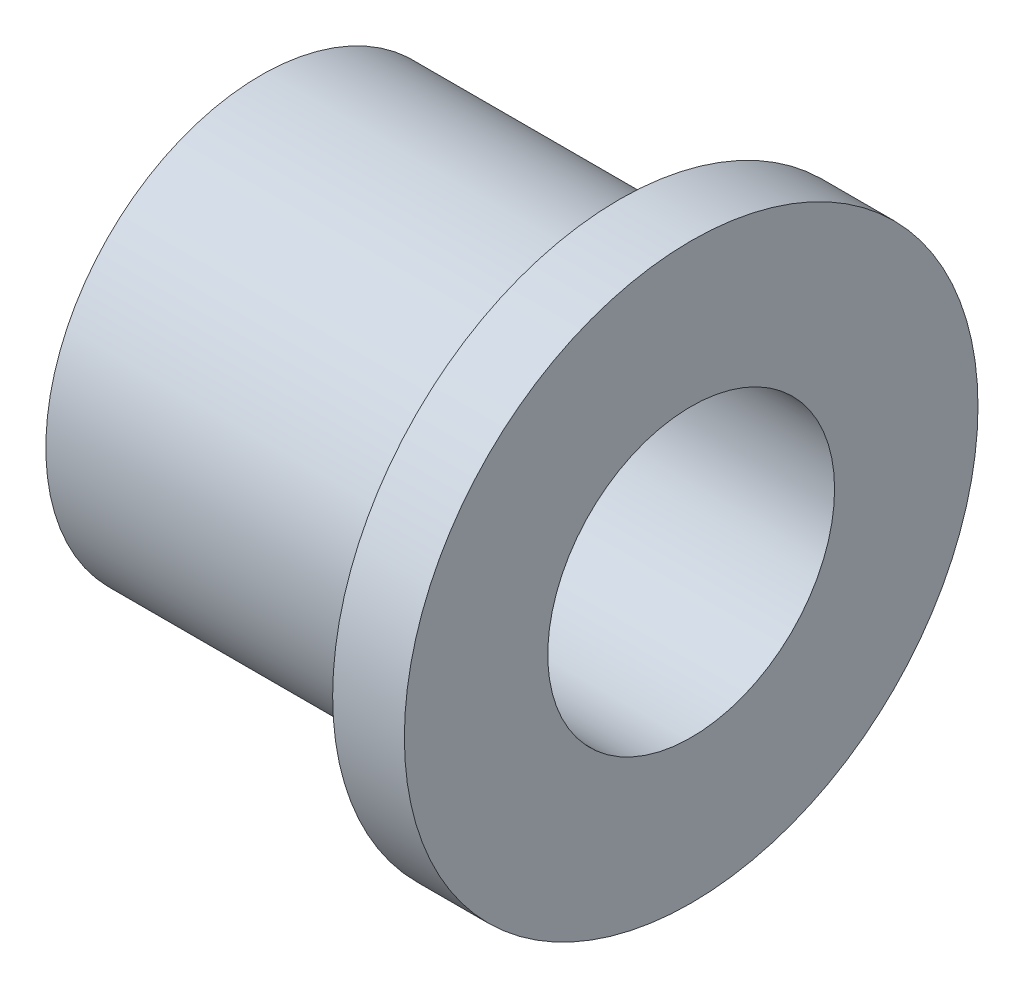
ISO-10303-21;
HEADER;
FILE_DESCRIPTION(('STEP AP214'),'2;1');
FILE_NAME('part.step','',(''),(''),'','','');
FILE_SCHEMA(('AUTOMOTIVE_DESIGN { 1 0 10303 214 1 1 1 1 }'));
ENDSEC;
DATA;
#1=APPLICATION_CONTEXT('core data for automotive mechanical design processes');
#2=APPLICATION_PROTOCOL_DEFINITION('international standard','automotive_design',2000,#1);
#3=PRODUCT_CONTEXT('',#1,'mechanical');
#4=PRODUCT('Part','Part','',(#3));
#5=PRODUCT_RELATED_PRODUCT_CATEGORY('part','',(#4));
#6=PRODUCT_DEFINITION_FORMATION('','',#4);
#7=PRODUCT_DEFINITION_CONTEXT('part definition',#1,'design');
#8=PRODUCT_DEFINITION('design','',#6,#7);
#9=PRODUCT_DEFINITION_SHAPE('','',#8);
#10=(LENGTH_UNIT() NAMED_UNIT(*) SI_UNIT(.MILLI.,.METRE.));
#11=(NAMED_UNIT(*) PLANE_ANGLE_UNIT() SI_UNIT($,.RADIAN.));
#12=(NAMED_UNIT(*) SI_UNIT($,.STERADIAN.) SOLID_ANGLE_UNIT());
#13=UNCERTAINTY_MEASURE_WITH_UNIT(LENGTH_MEASURE(1.E-05),#10,'distance_accuracy_value','');
#14=(GEOMETRIC_REPRESENTATION_CONTEXT(3) GLOBAL_UNCERTAINTY_ASSIGNED_CONTEXT((#13)) GLOBAL_UNIT_ASSIGNED_CONTEXT((#10,
#11,#12)) REPRESENTATION_CONTEXT('',''));
#15=CARTESIAN_POINT('',(0.,0.,0.));
#16=DIRECTION('',(0.,0.,1.));
#17=DIRECTION('',(1.,0.,0.));
#18=AXIS2_PLACEMENT_3D('',#15,#16,#17);
#19=CARTESIAN_POINT('',(-13.970784342,-6.4262,6.4262));
#20=DIRECTION('',(1.,0.,0.));
#21=DIRECTION('',(0.,0.,-1.));
#22=AXIS2_PLACEMENT_3D('',#19,#20,#21);
#23=PLANE('',#22);
#24=CARTESIAN_POINT('',(-13.970784342,0.,0.));
#25=DIRECTION('',(1.,0.,0.));
#26=DIRECTION('',(0.,0.,-1.));
#27=AXIS2_PLACEMENT_3D('',#24,#25,#26);
#28=CIRCLE('',#27,3.175);
#29=CARTESIAN_POINT('',(-13.970784342,0.,-3.175));
#30=VERTEX_POINT('',#29);
#31=EDGE_CURVE('E39',#30,#30,#28,.T.);
#32=ORIENTED_EDGE('',*,*,#31,.F.);
#33=EDGE_LOOP('',(#32));
#34=FACE_BOUND('',#33,.T.);
#35=CARTESIAN_POINT('',(-13.970784342,0.,0.));
#36=DIRECTION('',(1.,0.,0.));
#37=DIRECTION('',(0.,0.,-1.));
#38=AXIS2_PLACEMENT_3D('',#35,#36,#37);
#39=CIRCLE('',#38,6.35);
#40=CARTESIAN_POINT('',(-13.970784342,0.,-6.35));
#41=VERTEX_POINT('',#40);
#42=EDGE_CURVE('E18',#41,#41,#39,.T.);
#43=ORIENTED_EDGE('',*,*,#42,.T.);
#44=EDGE_LOOP('',(#43));
#45=FACE_BOUND('',#44,.T.);
#46=ADVANCED_FACE('F14',(#34,#45),#23,.T.);
#47=CARTESIAN_POINT('',(-15.558284342,0.,0.));
#48=DIRECTION('',(1.,0.,0.));
#49=DIRECTION('',(0.,0.,-1.));
#50=AXIS2_PLACEMENT_3D('',#47,#48,#49);
#51=CYLINDRICAL_SURFACE('',#50,6.35);
#52=ORIENTED_EDGE('',*,*,#42,.F.);
#53=EDGE_LOOP('',(#52));
#54=FACE_BOUND('',#53,.T.);
#55=CARTESIAN_POINT('',(-15.558284342,0.,0.));
#56=DIRECTION('',(1.,0.,0.));
#57=DIRECTION('',(0.,0.,-1.));
#58=AXIS2_PLACEMENT_3D('',#55,#56,#57);
#59=CIRCLE('',#58,6.35);
#60=CARTESIAN_POINT('',(-15.558284342,0.,-6.35));
#61=VERTEX_POINT('',#60);
#62=EDGE_CURVE('E37',#61,#61,#59,.F.);
#63=ORIENTED_EDGE('',*,*,#62,.F.);
#64=EDGE_LOOP('',(#63));
#65=FACE_BOUND('',#64,.T.);
#66=ADVANCED_FACE('F49',(#54,#65),#51,.T.);
#67=CARTESIAN_POINT('',(-23.495784342,0.,0.));
#68=DIRECTION('',(1.,0.,0.));
#69=DIRECTION('',(0.,0.,-1.));
#70=AXIS2_PLACEMENT_3D('',#67,#68,#69);
#71=CYLINDRICAL_SURFACE('',#70,3.175);
#72=ORIENTED_EDGE('',*,*,#31,.T.);
#73=EDGE_LOOP('',(#72));
#74=FACE_BOUND('',#73,.T.);
#75=CARTESIAN_POINT('',(-23.495784342,0.,0.));
#76=DIRECTION('',(1.,0.,0.));
#77=DIRECTION('',(0.,0.,-1.));
#78=AXIS2_PLACEMENT_3D('',#75,#76,#77);
#79=CIRCLE('',#78,3.175);
#80=CARTESIAN_POINT('',(-23.495784342,0.,-3.175));
#81=VERTEX_POINT('',#80);
#82=EDGE_CURVE('E31',#81,#81,#79,.T.);
#83=ORIENTED_EDGE('',*,*,#82,.F.);
#84=EDGE_LOOP('',(#83));
#85=FACE_BOUND('',#84,.T.);
#86=ADVANCED_FACE('F52',(#74,#85),#71,.F.);
#87=CARTESIAN_POINT('',(-15.558284342,-6.4262,-6.4262));
#88=DIRECTION('',(-1.,0.,0.));
#89=DIRECTION('',(0.,0.,1.));
#90=AXIS2_PLACEMENT_3D('',#87,#88,#89);
#91=PLANE('',#90);
#92=CARTESIAN_POINT('',(-15.558284342,0.,0.));
#93=DIRECTION('',(1.,0.,0.));
#94=DIRECTION('',(0.,0.,-1.));
#95=AXIS2_PLACEMENT_3D('',#92,#93,#94);
#96=CIRCLE('',#95,4.7625);
#97=CARTESIAN_POINT('',(-15.558284342,0.,-4.7625));
#98=VERTEX_POINT('',#97);
#99=EDGE_CURVE('E23',#98,#98,#96,.T.);
#100=ORIENTED_EDGE('',*,*,#99,.T.);
#101=EDGE_LOOP('',(#100));
#102=FACE_BOUND('',#101,.T.);
#103=ORIENTED_EDGE('',*,*,#62,.T.);
#104=EDGE_LOOP('',(#103));
#105=FACE_BOUND('',#104,.T.);
#106=ADVANCED_FACE('F56',(#102,#105),#91,.T.);
#107=CARTESIAN_POINT('',(-23.495784342,-4.81965,-4.81965));
#108=DIRECTION('',(-1.,0.,0.));
#109=DIRECTION('',(0.,0.,1.));
#110=AXIS2_PLACEMENT_3D('',#107,#108,#109);
#111=PLANE('',#110);
#112=ORIENTED_EDGE('',*,*,#82,.T.);
#113=EDGE_LOOP('',(#112));
#114=FACE_BOUND('',#113,.T.);
#115=CARTESIAN_POINT('',(-23.495784342,0.,0.));
#116=DIRECTION('',(1.,0.,0.));
#117=DIRECTION('',(0.,0.,-1.));
#118=AXIS2_PLACEMENT_3D('',#115,#116,#117);
#119=CIRCLE('',#118,4.7625);
#120=CARTESIAN_POINT('',(-23.495784342,0.,-4.7625));
#121=VERTEX_POINT('',#120);
#122=EDGE_CURVE('E10',#121,#121,#119,.F.);
#123=ORIENTED_EDGE('',*,*,#122,.T.);
#124=EDGE_LOOP('',(#123));
#125=FACE_BOUND('',#124,.T.);
#126=ADVANCED_FACE('F16',(#114,#125),#111,.T.);
#127=CARTESIAN_POINT('',(-23.495784342,0.,0.));
#128=DIRECTION('',(1.,0.,0.));
#129=DIRECTION('',(0.,0.,-1.));
#130=AXIS2_PLACEMENT_3D('',#127,#128,#129);
#131=CYLINDRICAL_SURFACE('',#130,4.7625);
#132=ORIENTED_EDGE('',*,*,#99,.F.);
#133=EDGE_LOOP('',(#132));
#134=FACE_BOUND('',#133,.T.);
#135=ORIENTED_EDGE('',*,*,#122,.F.);
#136=EDGE_LOOP('',(#135));
#137=FACE_BOUND('',#136,.T.);
#138=ADVANCED_FACE('F64',(#134,#137),#131,.T.);
#139=CLOSED_SHELL('',(#46,#66,#86,#106,#126,#138));
#140=MANIFOLD_SOLID_BREP('B1',#139);
#141=ADVANCED_BREP_SHAPE_REPRESENTATION('',(#18,#140),#14);
#142=SHAPE_DEFINITION_REPRESENTATION(#9,#141);
ENDSEC;
END-ISO-10303-21;
